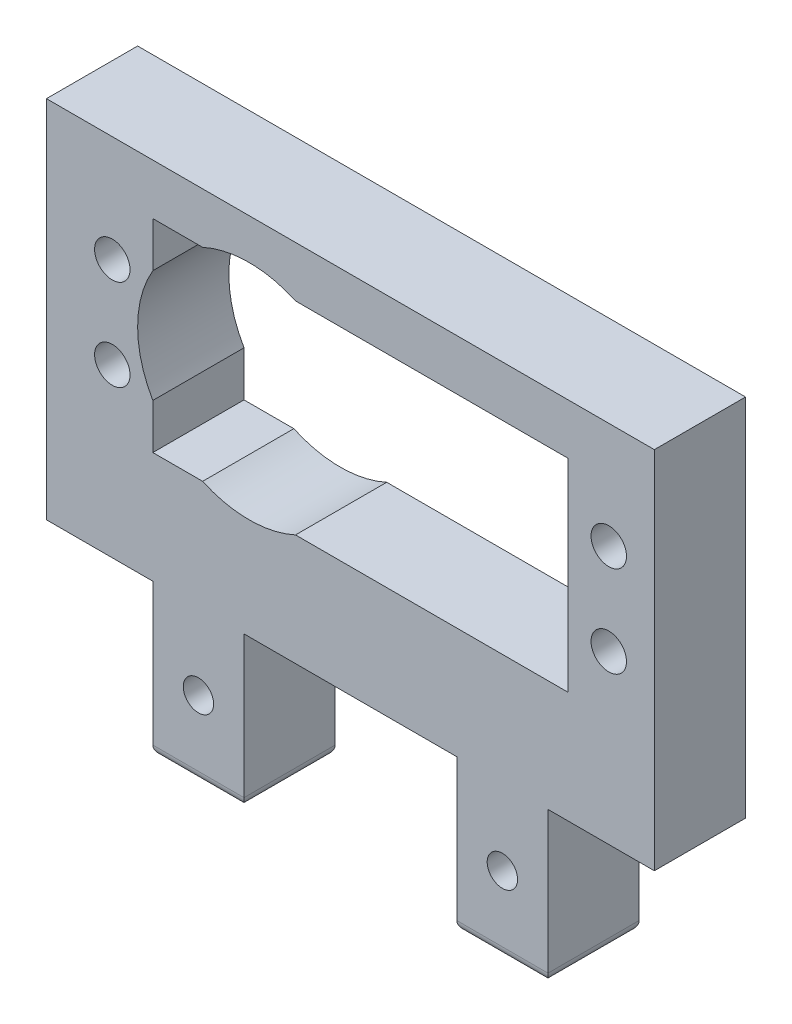
ISO-10303-21;
HEADER;
FILE_DESCRIPTION(('STEP AP214'),'2;1');
FILE_NAME('part.step','',(''),(''),'','','');
FILE_SCHEMA(('AUTOMOTIVE_DESIGN { 1 0 10303 214 1 1 1 1 }'));
ENDSEC;
DATA;
#1=APPLICATION_CONTEXT('core data for automotive mechanical design processes');
#2=APPLICATION_PROTOCOL_DEFINITION('international standard','automotive_design',2000,#1);
#3=PRODUCT_CONTEXT('',#1,'mechanical');
#4=PRODUCT('Part','Part','',(#3));
#5=PRODUCT_RELATED_PRODUCT_CATEGORY('part','',(#4));
#6=PRODUCT_DEFINITION_FORMATION('','',#4);
#7=PRODUCT_DEFINITION_CONTEXT('part definition',#1,'design');
#8=PRODUCT_DEFINITION('design','',#6,#7);
#9=PRODUCT_DEFINITION_SHAPE('','',#8);
#10=(LENGTH_UNIT() NAMED_UNIT(*) SI_UNIT(.MILLI.,.METRE.));
#11=(NAMED_UNIT(*) PLANE_ANGLE_UNIT() SI_UNIT($,.RADIAN.));
#12=(NAMED_UNIT(*) SI_UNIT($,.STERADIAN.) SOLID_ANGLE_UNIT());
#13=UNCERTAINTY_MEASURE_WITH_UNIT(LENGTH_MEASURE(1.E-05),#10,'distance_accuracy_value','');
#14=(GEOMETRIC_REPRESENTATION_CONTEXT(3) GLOBAL_UNCERTAINTY_ASSIGNED_CONTEXT((#13)) GLOBAL_UNIT_ASSIGNED_CONTEXT((#10,
#11,#12)) REPRESENTATION_CONTEXT('',''));
#15=CARTESIAN_POINT('',(0.,0.,0.));
#16=DIRECTION('',(0.,0.,1.));
#17=DIRECTION('',(1.,0.,0.));
#18=AXIS2_PLACEMENT_3D('',#15,#16,#17);
#19=CARTESIAN_POINT('',(0.,0.,9.));
#20=DIRECTION('',(0.,1.,0.));
#21=DIRECTION('',(0.,0.,1.));
#22=AXIS2_PLACEMENT_3D('',#19,#20,#21);
#23=PLANE('',#22);
#24=DIRECTION('',(1.,0.,0.));
#25=VECTOR('',#24,1.);
#26=CARTESIAN_POINT('',(0.,0.,0.));
#27=LINE('',#26,#25);
#28=CARTESIAN_POINT('',(0.,0.,0.));
#29=VERTEX_POINT('',#28);
#30=CARTESIAN_POINT('',(10.5,0.,0.));
#31=VERTEX_POINT('',#30);
#32=EDGE_CURVE('E329',#29,#31,#27,.T.);
#33=ORIENTED_EDGE('',*,*,#32,.T.);
#34=DIRECTION('',(0.,0.,-1.));
#35=VECTOR('',#34,1.);
#36=CARTESIAN_POINT('',(10.5,0.,9.));
#37=LINE('',#36,#35);
#38=CARTESIAN_POINT('',(10.5,0.,9.));
#39=VERTEX_POINT('',#38);
#40=EDGE_CURVE('E370',#39,#31,#37,.T.);
#41=ORIENTED_EDGE('',*,*,#40,.F.);
#42=DIRECTION('',(1.,0.,0.));
#43=VECTOR('',#42,1.);
#44=CARTESIAN_POINT('',(0.,0.,9.));
#45=LINE('',#44,#43);
#46=CARTESIAN_POINT('',(0.,0.,9.));
#47=VERTEX_POINT('',#46);
#48=EDGE_CURVE('E271',#47,#39,#45,.T.);
#49=ORIENTED_EDGE('',*,*,#48,.F.);
#50=DIRECTION('',(0.,0.,-1.));
#51=VECTOR('',#50,1.);
#52=CARTESIAN_POINT('',(0.,0.,9.));
#53=LINE('',#52,#51);
#54=EDGE_CURVE('E218',#47,#29,#53,.T.);
#55=ORIENTED_EDGE('',*,*,#54,.T.);
#56=EDGE_LOOP('',(#33,#41,#49,#55));
#57=FACE_BOUND('',#56,.T.);
#58=ADVANCED_FACE('F35',(#57),#23,.F.);
#59=CARTESIAN_POINT('',(10.5,0.,9.));
#60=DIRECTION('',(-1.,0.,0.));
#61=DIRECTION('',(0.,0.,1.));
#62=AXIS2_PLACEMENT_3D('',#59,#60,#61);
#63=PLANE('',#62);
#64=DIRECTION('',(0.,1.,0.));
#65=VECTOR('',#64,1.);
#66=CARTESIAN_POINT('',(10.5,0.,0.));
#67=LINE('',#66,#65);
#68=CARTESIAN_POINT('',(10.5,-14.,0.));
#69=VERTEX_POINT('',#68);
#70=EDGE_CURVE('E332',#69,#31,#67,.T.);
#71=ORIENTED_EDGE('',*,*,#70,.F.);
#72=DIRECTION('',(0.,0.,-1.));
#73=VECTOR('',#72,1.);
#74=CARTESIAN_POINT('',(10.5,-14.,9.));
#75=LINE('',#74,#73);
#76=CARTESIAN_POINT('',(10.5,-14.,9.));
#77=VERTEX_POINT('',#76);
#78=EDGE_CURVE('E44',#69,#77,#75,.F.);
#79=ORIENTED_EDGE('',*,*,#78,.T.);
#80=DIRECTION('',(0.,1.,0.));
#81=VECTOR('',#80,1.);
#82=CARTESIAN_POINT('',(10.5,0.,9.));
#83=LINE('',#82,#81);
#84=EDGE_CURVE('E274',#77,#39,#83,.T.);
#85=ORIENTED_EDGE('',*,*,#84,.T.);
#86=ORIENTED_EDGE('',*,*,#40,.T.);
#87=EDGE_LOOP('',(#71,#79,#85,#86));
#88=FACE_BOUND('',#87,.T.);
#89=ADVANCED_FACE('F486',(#88),#63,.T.);
#90=CARTESIAN_POINT('',(0.,-15.,9.));
#91=DIRECTION('',(0.,1.,0.));
#92=DIRECTION('',(0.,0.,1.));
#93=AXIS2_PLACEMENT_3D('',#90,#91,#92);
#94=PLANE('',#93);
#95=DIRECTION('',(1.,0.,0.));
#96=VECTOR('',#95,1.);
#97=CARTESIAN_POINT('',(10.5,-15.,8.));
#98=LINE('',#97,#96);
#99=CARTESIAN_POINT('',(18.5,-15.,8.));
#100=VERTEX_POINT('',#99);
#101=CARTESIAN_POINT('',(11.5,-15.,8.));
#102=VERTEX_POINT('',#101);
#103=EDGE_CURVE('E52',#100,#102,#98,.F.);
#104=ORIENTED_EDGE('',*,*,#103,.T.);
#105=DIRECTION('',(0.,0.,-1.));
#106=VECTOR('',#105,1.);
#107=CARTESIAN_POINT('',(11.5,-15.,0.));
#108=LINE('',#107,#106);
#109=CARTESIAN_POINT('',(11.5,-15.,0.999999999999999));
#110=VERTEX_POINT('',#109);
#111=EDGE_CURVE('E415',#102,#110,#108,.T.);
#112=ORIENTED_EDGE('',*,*,#111,.T.);
#113=DIRECTION('',(1.,0.,0.));
#114=VECTOR('',#113,1.);
#115=CARTESIAN_POINT('',(0.,-15.,0.999999999999999));
#116=LINE('',#115,#114);
#117=CARTESIAN_POINT('',(18.5,-15.,0.999999999999999));
#118=VERTEX_POINT('',#117);
#119=EDGE_CURVE('E411',#110,#118,#116,.T.);
#120=ORIENTED_EDGE('',*,*,#119,.T.);
#121=DIRECTION('',(0.,0.,-1.));
#122=VECTOR('',#121,1.);
#123=CARTESIAN_POINT('',(18.5,-15.,9.));
#124=LINE('',#123,#122);
#125=EDGE_CURVE('E57',#118,#100,#124,.F.);
#126=ORIENTED_EDGE('',*,*,#125,.T.);
#127=EDGE_LOOP('',(#104,#112,#120,#126));
#128=FACE_BOUND('',#127,.T.);
#129=ADVANCED_FACE('F493',(#128),#94,.F.);
#130=CARTESIAN_POINT('',(19.5,0.,9.));
#131=DIRECTION('',(-1.,0.,0.));
#132=DIRECTION('',(0.,-1.,0.));
#133=AXIS2_PLACEMENT_3D('',#130,#131,#132);
#134=PLANE('',#133);
#135=DIRECTION('',(0.,1.,0.));
#136=VECTOR('',#135,1.);
#137=CARTESIAN_POINT('',(19.5,0.,9.));
#138=LINE('',#137,#136);
#139=CARTESIAN_POINT('',(19.5,-14.,9.));
#140=VERTEX_POINT('',#139);
#141=CARTESIAN_POINT('',(19.5,0.,9.));
#142=VERTEX_POINT('',#141);
#143=EDGE_CURVE('E278',#140,#142,#138,.T.);
#144=ORIENTED_EDGE('',*,*,#143,.F.);
#145=DIRECTION('',(0.,0.,-1.));
#146=VECTOR('',#145,1.);
#147=CARTESIAN_POINT('',(19.5,-14.,9.));
#148=LINE('',#147,#146);
#149=CARTESIAN_POINT('',(19.5,-14.,0.));
#150=VERTEX_POINT('',#149);
#151=EDGE_CURVE('E11',#140,#150,#148,.T.);
#152=ORIENTED_EDGE('',*,*,#151,.T.);
#153=DIRECTION('',(0.,1.,0.));
#154=VECTOR('',#153,1.);
#155=CARTESIAN_POINT('',(19.5,0.,0.));
#156=LINE('',#155,#154);
#157=CARTESIAN_POINT('',(19.5,0.,0.));
#158=VERTEX_POINT('',#157);
#159=EDGE_CURVE('E336',#150,#158,#156,.T.);
#160=ORIENTED_EDGE('',*,*,#159,.T.);
#161=DIRECTION('',(0.,0.,-1.));
#162=VECTOR('',#161,1.);
#163=CARTESIAN_POINT('',(19.5,0.,9.));
#164=LINE('',#163,#162);
#165=EDGE_CURVE('E367',#142,#158,#164,.T.);
#166=ORIENTED_EDGE('',*,*,#165,.F.);
#167=EDGE_LOOP('',(#144,#152,#160,#166));
#168=FACE_BOUND('',#167,.T.);
#169=ADVANCED_FACE('F446',(#168),#134,.F.);
#170=CARTESIAN_POINT('',(40.5,0.,0.));
#171=VERTEX_POINT('',#170);
#172=EDGE_CURVE('E334',#158,#171,#27,.T.);
#173=ORIENTED_EDGE('',*,*,#172,.T.);
#174=DIRECTION('',(0.,0.,-1.));
#175=VECTOR('',#174,1.);
#176=CARTESIAN_POINT('',(40.5,0.,9.));
#177=LINE('',#176,#175);
#178=CARTESIAN_POINT('',(40.5,0.,9.));
#179=VERTEX_POINT('',#178);
#180=EDGE_CURVE('E364',#179,#171,#177,.T.);
#181=ORIENTED_EDGE('',*,*,#180,.F.);
#182=EDGE_CURVE('E276',#142,#179,#45,.T.);
#183=ORIENTED_EDGE('',*,*,#182,.F.);
#184=ORIENTED_EDGE('',*,*,#165,.T.);
#185=EDGE_LOOP('',(#173,#181,#183,#184));
#186=FACE_BOUND('',#185,.T.);
#187=ADVANCED_FACE('F500',(#186),#23,.F.);
#188=CARTESIAN_POINT('',(40.5,0.,9.));
#189=DIRECTION('',(-1.,0.,0.));
#190=DIRECTION('',(0.,-1.,0.));
#191=AXIS2_PLACEMENT_3D('',#188,#189,#190);
#192=PLANE('',#191);
#193=DIRECTION('',(0.,1.,0.));
#194=VECTOR('',#193,1.);
#195=CARTESIAN_POINT('',(40.5,0.,0.));
#196=LINE('',#195,#194);
#197=CARTESIAN_POINT('',(40.5,-14.,0.));
#198=VERTEX_POINT('',#197);
#199=EDGE_CURVE('E338',#198,#171,#196,.T.);
#200=ORIENTED_EDGE('',*,*,#199,.F.);
#201=DIRECTION('',(0.,0.,-1.));
#202=VECTOR('',#201,1.);
#203=CARTESIAN_POINT('',(40.5,-14.,9.));
#204=LINE('',#203,#202);
#205=CARTESIAN_POINT('',(40.5,-14.,9.));
#206=VERTEX_POINT('',#205);
#207=EDGE_CURVE('E398',#198,#206,#204,.F.);
#208=ORIENTED_EDGE('',*,*,#207,.T.);
#209=DIRECTION('',(0.,1.,0.));
#210=VECTOR('',#209,1.);
#211=CARTESIAN_POINT('',(40.5,0.,9.));
#212=LINE('',#211,#210);
#213=EDGE_CURVE('E280',#206,#179,#212,.T.);
#214=ORIENTED_EDGE('',*,*,#213,.T.);
#215=ORIENTED_EDGE('',*,*,#180,.T.);
#216=EDGE_LOOP('',(#200,#208,#214,#215));
#217=FACE_BOUND('',#216,.T.);
#218=ADVANCED_FACE('F510',(#217),#192,.T.);
#219=CARTESIAN_POINT('',(0.,-15.,9.));
#220=DIRECTION('',(0.,-1.,0.));
#221=DIRECTION('',(1.,0.,0.));
#222=AXIS2_PLACEMENT_3D('',#219,#220,#221);
#223=PLANE('',#222);
#224=DIRECTION('',(-1.,0.,0.));
#225=VECTOR('',#224,1.);
#226=CARTESIAN_POINT('',(0.,-15.,8.));
#227=LINE('',#226,#225);
#228=CARTESIAN_POINT('',(48.5,-15.,8.));
#229=VERTEX_POINT('',#228);
#230=CARTESIAN_POINT('',(41.5,-15.,8.));
#231=VERTEX_POINT('',#230);
#232=EDGE_CURVE('E393',#229,#231,#227,.T.);
#233=ORIENTED_EDGE('',*,*,#232,.T.);
#234=DIRECTION('',(0.,0.,-1.));
#235=VECTOR('',#234,1.);
#236=CARTESIAN_POINT('',(41.5,-15.,9.));
#237=LINE('',#236,#235);
#238=CARTESIAN_POINT('',(41.5,-15.,1.));
#239=VERTEX_POINT('',#238);
#240=EDGE_CURVE('E395',#231,#239,#237,.T.);
#241=ORIENTED_EDGE('',*,*,#240,.T.);
#242=DIRECTION('',(-1.,0.,0.));
#243=VECTOR('',#242,1.);
#244=CARTESIAN_POINT('',(49.5,-15.,1.));
#245=LINE('',#244,#243);
#246=CARTESIAN_POINT('',(48.5,-15.,1.));
#247=VERTEX_POINT('',#246);
#248=EDGE_CURVE('E373',#239,#247,#245,.F.);
#249=ORIENTED_EDGE('',*,*,#248,.T.);
#250=DIRECTION('',(0.,0.,-1.));
#251=VECTOR('',#250,1.);
#252=CARTESIAN_POINT('',(48.5,-15.,9.));
#253=LINE('',#252,#251);
#254=EDGE_CURVE('E391',#247,#229,#253,.F.);
#255=ORIENTED_EDGE('',*,*,#254,.T.);
#256=EDGE_LOOP('',(#233,#241,#249,#255));
#257=FACE_BOUND('',#256,.T.);
#258=ADVANCED_FACE('F517',(#257),#223,.T.);
#259=CARTESIAN_POINT('',(49.5,0.,9.));
#260=DIRECTION('',(-1.,0.,0.));
#261=DIRECTION('',(0.,0.,1.));
#262=AXIS2_PLACEMENT_3D('',#259,#260,#261);
#263=PLANE('',#262);
#264=DIRECTION('',(0.,1.,0.));
#265=VECTOR('',#264,1.);
#266=CARTESIAN_POINT('',(49.5,0.,9.));
#267=LINE('',#266,#265);
#268=CARTESIAN_POINT('',(49.5,-14.,9.));
#269=VERTEX_POINT('',#268);
#270=CARTESIAN_POINT('',(49.5,0.,9.));
#271=VERTEX_POINT('',#270);
#272=EDGE_CURVE('E282',#269,#271,#267,.T.);
#273=ORIENTED_EDGE('',*,*,#272,.F.);
#274=DIRECTION('',(0.,0.,-1.));
#275=VECTOR('',#274,1.);
#276=CARTESIAN_POINT('',(49.5,-14.,0.));
#277=LINE('',#276,#275);
#278=CARTESIAN_POINT('',(49.5,-14.,0.));
#279=VERTEX_POINT('',#278);
#280=EDGE_CURVE('E405',#269,#279,#277,.T.);
#281=ORIENTED_EDGE('',*,*,#280,.T.);
#282=DIRECTION('',(0.,1.,0.));
#283=VECTOR('',#282,1.);
#284=CARTESIAN_POINT('',(49.5,0.,0.));
#285=LINE('',#284,#283);
#286=CARTESIAN_POINT('',(49.5,0.,0.));
#287=VERTEX_POINT('',#286);
#288=EDGE_CURVE('E340',#279,#287,#285,.T.);
#289=ORIENTED_EDGE('',*,*,#288,.T.);
#290=DIRECTION('',(0.,0.,-1.));
#291=VECTOR('',#290,1.);
#292=CARTESIAN_POINT('',(49.5,0.,9.));
#293=LINE('',#292,#291);
#294=EDGE_CURVE('E361',#271,#287,#293,.T.);
#295=ORIENTED_EDGE('',*,*,#294,.F.);
#296=EDGE_LOOP('',(#273,#281,#289,#295));
#297=FACE_BOUND('',#296,.T.);
#298=ADVANCED_FACE('F512',(#297),#263,.F.);
#299=CARTESIAN_POINT('',(60.,0.,0.));
#300=VERTEX_POINT('',#299);
#301=EDGE_CURVE('E333',#287,#300,#27,.T.);
#302=ORIENTED_EDGE('',*,*,#301,.T.);
#303=DIRECTION('',(0.,0.,-1.));
#304=VECTOR('',#303,1.);
#305=CARTESIAN_POINT('',(60.,0.,9.));
#306=LINE('',#305,#304);
#307=CARTESIAN_POINT('',(60.,0.,9.));
#308=VERTEX_POINT('',#307);
#309=EDGE_CURVE('E358',#308,#300,#306,.T.);
#310=ORIENTED_EDGE('',*,*,#309,.F.);
#311=EDGE_CURVE('E275',#271,#308,#45,.T.);
#312=ORIENTED_EDGE('',*,*,#311,.F.);
#313=ORIENTED_EDGE('',*,*,#294,.T.);
#314=EDGE_LOOP('',(#302,#310,#312,#313));
#315=FACE_BOUND('',#314,.T.);
#316=ADVANCED_FACE('F461',(#315),#23,.F.);
#317=CARTESIAN_POINT('',(60.,0.,9.));
#318=DIRECTION('',(-1.,0.,0.));
#319=DIRECTION('',(0.,-1.,0.));
#320=AXIS2_PLACEMENT_3D('',#317,#318,#319);
#321=PLANE('',#320);
#322=DIRECTION('',(0.,1.,0.));
#323=VECTOR('',#322,1.);
#324=CARTESIAN_POINT('',(60.,0.,0.));
#325=LINE('',#324,#323);
#326=CARTESIAN_POINT('',(60.,36.,0.));
#327=VERTEX_POINT('',#326);
#328=EDGE_CURVE('E342',#300,#327,#325,.T.);
#329=ORIENTED_EDGE('',*,*,#328,.T.);
#330=DIRECTION('',(0.,0.,-1.));
#331=VECTOR('',#330,1.);
#332=CARTESIAN_POINT('',(60.,36.,9.));
#333=LINE('',#332,#331);
#334=CARTESIAN_POINT('',(60.,36.,9.));
#335=VERTEX_POINT('',#334);
#336=EDGE_CURVE('E356',#335,#327,#333,.T.);
#337=ORIENTED_EDGE('',*,*,#336,.F.);
#338=DIRECTION('',(0.,1.,0.));
#339=VECTOR('',#338,1.);
#340=CARTESIAN_POINT('',(60.,0.,9.));
#341=LINE('',#340,#339);
#342=EDGE_CURVE('E284',#308,#335,#341,.T.);
#343=ORIENTED_EDGE('',*,*,#342,.F.);
#344=ORIENTED_EDGE('',*,*,#309,.T.);
#345=EDGE_LOOP('',(#329,#337,#343,#344));
#346=FACE_BOUND('',#345,.T.);
#347=ADVANCED_FACE('F467',(#346),#321,.F.);
#348=CARTESIAN_POINT('',(0.,36.,9.));
#349=DIRECTION('',(0.,1.,0.));
#350=DIRECTION('',(0.,0.,1.));
#351=AXIS2_PLACEMENT_3D('',#348,#349,#350);
#352=PLANE('',#351);
#353=DIRECTION('',(1.,0.,0.));
#354=VECTOR('',#353,1.);
#355=CARTESIAN_POINT('',(0.,36.,0.));
#356=LINE('',#355,#354);
#357=CARTESIAN_POINT('',(0.,36.,0.));
#358=VERTEX_POINT('',#357);
#359=EDGE_CURVE('E345',#358,#327,#356,.T.);
#360=ORIENTED_EDGE('',*,*,#359,.F.);
#361=DIRECTION('',(0.,0.,-1.));
#362=VECTOR('',#361,1.);
#363=CARTESIAN_POINT('',(0.,36.,9.));
#364=LINE('',#363,#362);
#365=CARTESIAN_POINT('',(0.,36.,9.));
#366=VERTEX_POINT('',#365);
#367=EDGE_CURVE('E354',#366,#358,#364,.T.);
#368=ORIENTED_EDGE('',*,*,#367,.F.);
#369=DIRECTION('',(1.,0.,0.));
#370=VECTOR('',#369,1.);
#371=CARTESIAN_POINT('',(0.,36.,9.));
#372=LINE('',#371,#370);
#373=EDGE_CURVE('E286',#366,#335,#372,.T.);
#374=ORIENTED_EDGE('',*,*,#373,.T.);
#375=ORIENTED_EDGE('',*,*,#336,.T.);
#376=EDGE_LOOP('',(#360,#368,#374,#375));
#377=FACE_BOUND('',#376,.T.);
#378=ADVANCED_FACE('F473',(#377),#352,.T.);
#379=CARTESIAN_POINT('',(20.,21.,9.));
#380=DIRECTION('',(0.,0.,-1.));
#381=DIRECTION('',(-1.,0.,0.));
#382=AXIS2_PLACEMENT_3D('',#379,#380,#381);
#383=CYLINDRICAL_SURFACE('',#382,11.);
#384=CARTESIAN_POINT('',(20.,21.,0.));
#385=DIRECTION('',(0.,0.,1.));
#386=DIRECTION('',(1.,0.,0.));
#387=AXIS2_PLACEMENT_3D('',#384,#385,#386);
#388=CIRCLE('',#387,11.);
#389=CARTESIAN_POINT('',(24.5825756949558,31.,0.));
#390=VERTEX_POINT('',#389);
#391=CARTESIAN_POINT('',(15.4174243050442,31.,0.));
#392=VERTEX_POINT('',#391);
#393=EDGE_CURVE('E215',#390,#392,#388,.T.);
#394=ORIENTED_EDGE('',*,*,#393,.F.);
#395=DIRECTION('',(0.,0.,-1.));
#396=VECTOR('',#395,1.);
#397=CARTESIAN_POINT('',(24.5825756949558,31.,9.));
#398=LINE('',#397,#396);
#399=CARTESIAN_POINT('',(24.5825756949558,31.,9.));
#400=VERTEX_POINT('',#399);
#401=EDGE_CURVE('E209',#400,#390,#398,.T.);
#402=ORIENTED_EDGE('',*,*,#401,.F.);
#403=CARTESIAN_POINT('',(20.,21.,9.));
#404=DIRECTION('',(0.,0.,1.));
#405=DIRECTION('',(1.,0.,0.));
#406=AXIS2_PLACEMENT_3D('',#403,#404,#405);
#407=CIRCLE('',#406,11.);
#408=CARTESIAN_POINT('',(15.4174243050442,31.,9.));
#409=VERTEX_POINT('',#408);
#410=EDGE_CURVE('E213',#400,#409,#407,.T.);
#411=ORIENTED_EDGE('',*,*,#410,.T.);
#412=DIRECTION('',(0.,0.,-1.));
#413=VECTOR('',#412,1.);
#414=CARTESIAN_POINT('',(15.4174243050442,31.,9.));
#415=LINE('',#414,#413);
#416=EDGE_CURVE('E298',#409,#392,#415,.T.);
#417=ORIENTED_EDGE('',*,*,#416,.T.);
#418=EDGE_LOOP('',(#394,#402,#411,#417));
#419=FACE_BOUND('',#418,.T.);
#420=ADVANCED_FACE('F211',(#419),#383,.F.);
#421=CARTESIAN_POINT('',(0.,31.,9.));
#422=DIRECTION('',(0.,1.,0.));
#423=DIRECTION('',(0.,0.,1.));
#424=AXIS2_PLACEMENT_3D('',#421,#422,#423);
#425=PLANE('',#424);
#426=DIRECTION('',(1.,0.,0.));
#427=VECTOR('',#426,1.);
#428=CARTESIAN_POINT('',(0.,31.,0.));
#429=LINE('',#428,#427);
#430=CARTESIAN_POINT('',(51.5,31.,0.));
#431=VERTEX_POINT('',#430);
#432=EDGE_CURVE('E300',#390,#431,#429,.T.);
#433=ORIENTED_EDGE('',*,*,#432,.T.);
#434=DIRECTION('',(0.,0.,-1.));
#435=VECTOR('',#434,1.);
#436=CARTESIAN_POINT('',(51.5,31.,9.));
#437=LINE('',#436,#435);
#438=CARTESIAN_POINT('',(51.5,31.,9.));
#439=VERTEX_POINT('',#438);
#440=EDGE_CURVE('E219',#439,#431,#437,.T.);
#441=ORIENTED_EDGE('',*,*,#440,.F.);
#442=DIRECTION('',(1.,0.,0.));
#443=VECTOR('',#442,1.);
#444=CARTESIAN_POINT('',(0.,31.,9.));
#445=LINE('',#444,#443);
#446=EDGE_CURVE('E222',#400,#439,#445,.T.);
#447=ORIENTED_EDGE('',*,*,#446,.F.);
#448=ORIENTED_EDGE('',*,*,#401,.T.);
#449=EDGE_LOOP('',(#433,#441,#447,#448));
#450=FACE_BOUND('',#449,.T.);
#451=ADVANCED_FACE('F223',(#450),#425,.F.);
#452=CARTESIAN_POINT('',(51.5,0.,9.));
#453=DIRECTION('',(1.,0.,0.));
#454=DIRECTION('',(0.,1.,0.));
#455=AXIS2_PLACEMENT_3D('',#452,#453,#454);
#456=PLANE('',#455);
#457=DIRECTION('',(0.,-1.,0.));
#458=VECTOR('',#457,1.);
#459=CARTESIAN_POINT('',(51.5,0.,0.));
#460=LINE('',#459,#458);
#461=CARTESIAN_POINT('',(51.5,11.,0.));
#462=VERTEX_POINT('',#461);
#463=EDGE_CURVE('E305',#431,#462,#460,.T.);
#464=ORIENTED_EDGE('',*,*,#463,.T.);
#465=DIRECTION('',(0.,0.,-1.));
#466=VECTOR('',#465,1.);
#467=CARTESIAN_POINT('',(51.5,11.,9.));
#468=LINE('',#467,#466);
#469=CARTESIAN_POINT('',(51.5,11.,9.));
#470=VERTEX_POINT('',#469);
#471=EDGE_CURVE('E387',#470,#462,#468,.T.);
#472=ORIENTED_EDGE('',*,*,#471,.F.);
#473=DIRECTION('',(0.,-1.,0.));
#474=VECTOR('',#473,1.);
#475=CARTESIAN_POINT('',(51.5,0.,9.));
#476=LINE('',#475,#474);
#477=EDGE_CURVE('E227',#439,#470,#476,.T.);
#478=ORIENTED_EDGE('',*,*,#477,.F.);
#479=ORIENTED_EDGE('',*,*,#440,.T.);
#480=EDGE_LOOP('',(#464,#472,#478,#479));
#481=FACE_BOUND('',#480,.T.);
#482=ADVANCED_FACE('F577',(#481),#456,.F.);
#483=CARTESIAN_POINT('',(0.,11.,9.));
#484=DIRECTION('',(0.,1.,0.));
#485=DIRECTION('',(0.,0.,1.));
#486=AXIS2_PLACEMENT_3D('',#483,#484,#485);
#487=PLANE('',#486);
#488=DIRECTION('',(1.,0.,0.));
#489=VECTOR('',#488,1.);
#490=CARTESIAN_POINT('',(0.,11.,0.));
#491=LINE('',#490,#489);
#492=CARTESIAN_POINT('',(24.5825756949558,11.,0.));
#493=VERTEX_POINT('',#492);
#494=EDGE_CURVE('E309',#493,#462,#491,.T.);
#495=ORIENTED_EDGE('',*,*,#494,.F.);
#496=DIRECTION('',(0.,0.,-1.));
#497=VECTOR('',#496,1.);
#498=CARTESIAN_POINT('',(24.5825756949558,11.,9.));
#499=LINE('',#498,#497);
#500=CARTESIAN_POINT('',(24.5825756949558,11.,9.));
#501=VERTEX_POINT('',#500);
#502=EDGE_CURVE('E385',#501,#493,#499,.T.);
#503=ORIENTED_EDGE('',*,*,#502,.F.);
#504=DIRECTION('',(1.,0.,0.));
#505=VECTOR('',#504,1.);
#506=CARTESIAN_POINT('',(0.,11.,9.));
#507=LINE('',#506,#505);
#508=EDGE_CURVE('E247',#501,#470,#507,.T.);
#509=ORIENTED_EDGE('',*,*,#508,.T.);
#510=ORIENTED_EDGE('',*,*,#471,.T.);
#511=EDGE_LOOP('',(#495,#503,#509,#510));
#512=FACE_BOUND('',#511,.T.);
#513=ADVANCED_FACE('F580',(#512),#487,.T.);
#514=CARTESIAN_POINT('',(15.4174243050442,11.,0.));
#515=VERTEX_POINT('',#514);
#516=EDGE_CURVE('E303',#515,#493,#388,.T.);
#517=ORIENTED_EDGE('',*,*,#516,.F.);
#518=DIRECTION('',(0.,0.,-1.));
#519=VECTOR('',#518,1.);
#520=CARTESIAN_POINT('',(15.4174243050442,11.,9.));
#521=LINE('',#520,#519);
#522=CARTESIAN_POINT('',(15.4174243050442,11.,9.));
#523=VERTEX_POINT('',#522);
#524=EDGE_CURVE('E383',#523,#515,#521,.T.);
#525=ORIENTED_EDGE('',*,*,#524,.F.);
#526=EDGE_CURVE('E238',#523,#501,#407,.T.);
#527=ORIENTED_EDGE('',*,*,#526,.T.);
#528=ORIENTED_EDGE('',*,*,#502,.T.);
#529=EDGE_LOOP('',(#517,#525,#527,#528));
#530=FACE_BOUND('',#529,.T.);
#531=ADVANCED_FACE('F586',(#530),#383,.F.);
#532=CARTESIAN_POINT('',(10.5,11.,0.));
#533=VERTEX_POINT('',#532);
#534=EDGE_CURVE('E312',#533,#515,#491,.T.);
#535=ORIENTED_EDGE('',*,*,#534,.F.);
#536=DIRECTION('',(0.,0.,-1.));
#537=VECTOR('',#536,1.);
#538=CARTESIAN_POINT('',(10.5,11.,9.));
#539=LINE('',#538,#537);
#540=CARTESIAN_POINT('',(10.5,11.,9.));
#541=VERTEX_POINT('',#540);
#542=EDGE_CURVE('E381',#541,#533,#539,.T.);
#543=ORIENTED_EDGE('',*,*,#542,.F.);
#544=EDGE_CURVE('E246',#541,#523,#507,.T.);
#545=ORIENTED_EDGE('',*,*,#544,.T.);
#546=ORIENTED_EDGE('',*,*,#524,.T.);
#547=EDGE_LOOP('',(#535,#543,#545,#546));
#548=FACE_BOUND('',#547,.T.);
#549=ADVANCED_FACE('F582',(#548),#487,.T.);
#550=CARTESIAN_POINT('',(10.5,0.,9.));
#551=DIRECTION('',(1.,0.,0.));
#552=DIRECTION('',(0.,1.,0.));
#553=AXIS2_PLACEMENT_3D('',#550,#551,#552);
#554=PLANE('',#553);
#555=DIRECTION('',(0.,-1.,0.));
#556=VECTOR('',#555,1.);
#557=CARTESIAN_POINT('',(10.5,0.,0.));
#558=LINE('',#557,#556);
#559=CARTESIAN_POINT('',(10.5,15.4547317467953,0.));
#560=VERTEX_POINT('',#559);
#561=EDGE_CURVE('E313',#560,#533,#558,.T.);
#562=ORIENTED_EDGE('',*,*,#561,.F.);
#563=DIRECTION('',(0.,0.,-1.));
#564=VECTOR('',#563,1.);
#565=CARTESIAN_POINT('',(10.5,15.4547317467953,9.));
#566=LINE('',#565,#564);
#567=CARTESIAN_POINT('',(10.5,15.4547317467953,9.));
#568=VERTEX_POINT('',#567);
#569=EDGE_CURVE('E379',#568,#560,#566,.T.);
#570=ORIENTED_EDGE('',*,*,#569,.F.);
#571=DIRECTION('',(0.,-1.,0.));
#572=VECTOR('',#571,1.);
#573=CARTESIAN_POINT('',(10.5,0.,9.));
#574=LINE('',#573,#572);
#575=EDGE_CURVE('E244',#568,#541,#574,.T.);
#576=ORIENTED_EDGE('',*,*,#575,.T.);
#577=ORIENTED_EDGE('',*,*,#542,.T.);
#578=EDGE_LOOP('',(#562,#570,#576,#577));
#579=FACE_BOUND('',#578,.T.);
#580=ADVANCED_FACE('F585',(#579),#554,.T.);
#581=CARTESIAN_POINT('',(10.5,26.5452682532047,0.));
#582=VERTEX_POINT('',#581);
#583=EDGE_CURVE('E302',#582,#560,#388,.T.);
#584=ORIENTED_EDGE('',*,*,#583,.F.);
#585=DIRECTION('',(0.,0.,-1.));
#586=VECTOR('',#585,1.);
#587=CARTESIAN_POINT('',(10.5,26.5452682532047,9.));
#588=LINE('',#587,#586);
#589=CARTESIAN_POINT('',(10.5,26.5452682532047,9.));
#590=VERTEX_POINT('',#589);
#591=EDGE_CURVE('E377',#590,#582,#588,.T.);
#592=ORIENTED_EDGE('',*,*,#591,.F.);
#593=EDGE_CURVE('E237',#590,#568,#407,.T.);
#594=ORIENTED_EDGE('',*,*,#593,.T.);
#595=ORIENTED_EDGE('',*,*,#569,.T.);
#596=EDGE_LOOP('',(#584,#592,#594,#595));
#597=FACE_BOUND('',#596,.T.);
#598=ADVANCED_FACE('F588',(#597),#383,.F.);
#599=CARTESIAN_POINT('',(10.5,31.,0.));
#600=VERTEX_POINT('',#599);
#601=EDGE_CURVE('E316',#600,#582,#558,.T.);
#602=ORIENTED_EDGE('',*,*,#601,.F.);
#603=DIRECTION('',(0.,0.,-1.));
#604=VECTOR('',#603,1.);
#605=CARTESIAN_POINT('',(10.5,31.,9.));
#606=LINE('',#605,#604);
#607=CARTESIAN_POINT('',(10.5,31.,9.));
#608=VERTEX_POINT('',#607);
#609=EDGE_CURVE('E375',#608,#600,#606,.T.);
#610=ORIENTED_EDGE('',*,*,#609,.F.);
#611=EDGE_CURVE('E243',#608,#590,#574,.T.);
#612=ORIENTED_EDGE('',*,*,#611,.T.);
#613=ORIENTED_EDGE('',*,*,#591,.T.);
#614=EDGE_LOOP('',(#602,#610,#612,#613));
#615=FACE_BOUND('',#614,.T.);
#616=ADVANCED_FACE('F591',(#615),#554,.T.);
#617=CARTESIAN_POINT('',(45.,-7.5,9.));
#618=DIRECTION('',(0.,0.,-1.));
#619=DIRECTION('',(-1.,0.,0.));
#620=AXIS2_PLACEMENT_3D('',#617,#618,#619);
#621=CYLINDRICAL_SURFACE('',#620,1.5);
#622=CARTESIAN_POINT('',(45.,-7.5,9.));
#623=DIRECTION('',(0.,0.,1.));
#624=DIRECTION('',(1.,0.,0.));
#625=AXIS2_PLACEMENT_3D('',#622,#623,#624);
#626=CIRCLE('',#625,1.5);
#627=CARTESIAN_POINT('',(46.5,-7.5,9.));
#628=VERTEX_POINT('',#627);
#629=EDGE_CURVE('E292',#628,#628,#626,.T.);
#630=ORIENTED_EDGE('',*,*,#629,.T.);
#631=EDGE_LOOP('',(#630));
#632=FACE_BOUND('',#631,.T.);
#633=CARTESIAN_POINT('',(45.,-7.5,0.));
#634=DIRECTION('',(0.,0.,1.));
#635=DIRECTION('',(1.,0.,0.));
#636=AXIS2_PLACEMENT_3D('',#633,#634,#635);
#637=CIRCLE('',#636,1.5);
#638=CARTESIAN_POINT('',(46.5,-7.5,0.));
#639=VERTEX_POINT('',#638);
#640=EDGE_CURVE('E240',#639,#639,#637,.T.);
#641=ORIENTED_EDGE('',*,*,#640,.F.);
#642=EDGE_LOOP('',(#641));
#643=FACE_BOUND('',#642,.T.);
#644=ADVANCED_FACE('F595',(#632,#643),#621,.F.);
#645=CARTESIAN_POINT('',(0.,0.,9.));
#646=DIRECTION('',(-1.,0.,0.));
#647=DIRECTION('',(0.,0.,1.));
#648=AXIS2_PLACEMENT_3D('',#645,#646,#647);
#649=PLANE('',#648);
#650=DIRECTION('',(0.,1.,0.));
#651=VECTOR('',#650,1.);
#652=CARTESIAN_POINT('',(0.,0.,0.));
#653=LINE('',#652,#651);
#654=EDGE_CURVE('E348',#29,#358,#653,.T.);
#655=ORIENTED_EDGE('',*,*,#654,.F.);
#656=ORIENTED_EDGE('',*,*,#54,.F.);
#657=DIRECTION('',(0.,1.,0.));
#658=VECTOR('',#657,1.);
#659=CARTESIAN_POINT('',(0.,0.,9.));
#660=LINE('',#659,#658);
#661=EDGE_CURVE('E289',#47,#366,#660,.T.);
#662=ORIENTED_EDGE('',*,*,#661,.T.);
#663=ORIENTED_EDGE('',*,*,#367,.T.);
#664=EDGE_LOOP('',(#655,#656,#662,#663));
#665=FACE_BOUND('',#664,.T.);
#666=ADVANCED_FACE('F480',(#665),#649,.T.);
#667=CARTESIAN_POINT('',(6.5,25.5,9.));
#668=DIRECTION('',(0.,0.,-1.));
#669=DIRECTION('',(-1.,0.,0.));
#670=AXIS2_PLACEMENT_3D('',#667,#668,#669);
#671=CYLINDRICAL_SURFACE('',#670,1.75000000000001);
#672=CARTESIAN_POINT('',(6.5,25.5,9.));
#673=DIRECTION('',(0.,0.,1.));
#674=DIRECTION('',(1.,0.,0.));
#675=AXIS2_PLACEMENT_3D('',#672,#673,#674);
#676=CIRCLE('',#675,1.75000000000001);
#677=CARTESIAN_POINT('',(8.25,25.5,9.));
#678=VERTEX_POINT('',#677);
#679=EDGE_CURVE('E268',#678,#678,#676,.T.);
#680=ORIENTED_EDGE('',*,*,#679,.T.);
#681=EDGE_LOOP('',(#680));
#682=FACE_BOUND('',#681,.T.);
#683=CARTESIAN_POINT('',(6.5,25.5,0.));
#684=DIRECTION('',(0.,0.,1.));
#685=DIRECTION('',(1.,0.,0.));
#686=AXIS2_PLACEMENT_3D('',#683,#684,#685);
#687=CIRCLE('',#686,1.75000000000001);
#688=CARTESIAN_POINT('',(8.25,25.5,0.));
#689=VERTEX_POINT('',#688);
#690=EDGE_CURVE('E326',#689,#689,#687,.T.);
#691=ORIENTED_EDGE('',*,*,#690,.F.);
#692=EDGE_LOOP('',(#691));
#693=FACE_BOUND('',#692,.T.);
#694=ADVANCED_FACE('F613',(#682,#693),#671,.F.);
#695=CARTESIAN_POINT('',(6.5,16.5,9.));
#696=DIRECTION('',(0.,0.,-1.));
#697=DIRECTION('',(-1.,0.,0.));
#698=AXIS2_PLACEMENT_3D('',#695,#696,#697);
#699=CYLINDRICAL_SURFACE('',#698,1.75);
#700=CARTESIAN_POINT('',(6.5,16.5,9.));
#701=DIRECTION('',(0.,0.,1.));
#702=DIRECTION('',(1.,0.,0.));
#703=AXIS2_PLACEMENT_3D('',#700,#701,#702);
#704=CIRCLE('',#703,1.75);
#705=CARTESIAN_POINT('',(8.25,16.5,9.));
#706=VERTEX_POINT('',#705);
#707=EDGE_CURVE('E265',#706,#706,#704,.T.);
#708=ORIENTED_EDGE('',*,*,#707,.T.);
#709=EDGE_LOOP('',(#708));
#710=FACE_BOUND('',#709,.T.);
#711=CARTESIAN_POINT('',(6.5,16.5,0.));
#712=DIRECTION('',(0.,0.,1.));
#713=DIRECTION('',(1.,0.,0.));
#714=AXIS2_PLACEMENT_3D('',#711,#712,#713);
#715=CIRCLE('',#714,1.75);
#716=CARTESIAN_POINT('',(8.25,16.5,0.));
#717=VERTEX_POINT('',#716);
#718=EDGE_CURVE('E323',#717,#717,#715,.T.);
#719=ORIENTED_EDGE('',*,*,#718,.F.);
#720=EDGE_LOOP('',(#719));
#721=FACE_BOUND('',#720,.T.);
#722=ADVANCED_FACE('F609',(#710,#721),#699,.F.);
#723=CARTESIAN_POINT('',(55.5,25.5,9.));
#724=DIRECTION('',(0.,0.,-1.));
#725=DIRECTION('',(-1.,0.,0.));
#726=AXIS2_PLACEMENT_3D('',#723,#724,#725);
#727=CYLINDRICAL_SURFACE('',#726,1.75);
#728=CARTESIAN_POINT('',(55.5,25.5,9.));
#729=DIRECTION('',(0.,0.,1.));
#730=DIRECTION('',(1.,0.,0.));
#731=AXIS2_PLACEMENT_3D('',#728,#729,#730);
#732=CIRCLE('',#731,1.75);
#733=CARTESIAN_POINT('',(57.25,25.5,9.));
#734=VERTEX_POINT('',#733);
#735=EDGE_CURVE('E262',#734,#734,#732,.T.);
#736=ORIENTED_EDGE('',*,*,#735,.T.);
#737=EDGE_LOOP('',(#736));
#738=FACE_BOUND('',#737,.T.);
#739=CARTESIAN_POINT('',(55.5,25.5,0.));
#740=DIRECTION('',(0.,0.,1.));
#741=DIRECTION('',(1.,0.,0.));
#742=AXIS2_PLACEMENT_3D('',#739,#740,#741);
#743=CIRCLE('',#742,1.75);
#744=CARTESIAN_POINT('',(57.25,25.5,0.));
#745=VERTEX_POINT('',#744);
#746=EDGE_CURVE('E320',#745,#745,#743,.T.);
#747=ORIENTED_EDGE('',*,*,#746,.F.);
#748=EDGE_LOOP('',(#747));
#749=FACE_BOUND('',#748,.T.);
#750=ADVANCED_FACE('F605',(#738,#749),#727,.F.);
#751=CARTESIAN_POINT('',(55.5,16.5,9.));
#752=DIRECTION('',(0.,0.,-1.));
#753=DIRECTION('',(-1.,0.,0.));
#754=AXIS2_PLACEMENT_3D('',#751,#752,#753);
#755=CYLINDRICAL_SURFACE('',#754,1.75);
#756=CARTESIAN_POINT('',(55.5,16.5,9.));
#757=DIRECTION('',(0.,0.,1.));
#758=DIRECTION('',(1.,0.,0.));
#759=AXIS2_PLACEMENT_3D('',#756,#757,#758);
#760=CIRCLE('',#759,1.75);
#761=CARTESIAN_POINT('',(57.25,16.5,9.));
#762=VERTEX_POINT('',#761);
#763=EDGE_CURVE('E259',#762,#762,#760,.T.);
#764=ORIENTED_EDGE('',*,*,#763,.T.);
#765=EDGE_LOOP('',(#764));
#766=FACE_BOUND('',#765,.T.);
#767=CARTESIAN_POINT('',(55.5,16.5,0.));
#768=DIRECTION('',(0.,0.,1.));
#769=DIRECTION('',(1.,0.,0.));
#770=AXIS2_PLACEMENT_3D('',#767,#768,#769);
#771=CIRCLE('',#770,1.75);
#772=CARTESIAN_POINT('',(57.25,16.5,0.));
#773=VERTEX_POINT('',#772);
#774=EDGE_CURVE('E317',#773,#773,#771,.T.);
#775=ORIENTED_EDGE('',*,*,#774,.F.);
#776=EDGE_LOOP('',(#775));
#777=FACE_BOUND('',#776,.T.);
#778=ADVANCED_FACE('F601',(#766,#777),#755,.F.);
#779=EDGE_CURVE('E306',#600,#392,#429,.T.);
#780=ORIENTED_EDGE('',*,*,#779,.T.);
#781=ORIENTED_EDGE('',*,*,#416,.F.);
#782=EDGE_CURVE('E229',#608,#409,#445,.T.);
#783=ORIENTED_EDGE('',*,*,#782,.F.);
#784=ORIENTED_EDGE('',*,*,#609,.T.);
#785=EDGE_LOOP('',(#780,#781,#783,#784));
#786=FACE_BOUND('',#785,.T.);
#787=ADVANCED_FACE('F597',(#786),#425,.F.);
#788=CARTESIAN_POINT('',(15.,-7.5,9.));
#789=DIRECTION('',(0.,0.,-1.));
#790=DIRECTION('',(-1.,0.,0.));
#791=AXIS2_PLACEMENT_3D('',#788,#789,#790);
#792=CYLINDRICAL_SURFACE('',#791,1.5);
#793=CARTESIAN_POINT('',(15.,-7.5,9.));
#794=DIRECTION('',(0.,0.,1.));
#795=DIRECTION('',(1.,0.,0.));
#796=AXIS2_PLACEMENT_3D('',#793,#794,#795);
#797=CIRCLE('',#796,1.5);
#798=CARTESIAN_POINT('',(16.5,-7.5,9.));
#799=VERTEX_POINT('',#798);
#800=EDGE_CURVE('E295',#799,#799,#797,.T.);
#801=ORIENTED_EDGE('',*,*,#800,.T.);
#802=EDGE_LOOP('',(#801));
#803=FACE_BOUND('',#802,.T.);
#804=CARTESIAN_POINT('',(15.,-7.5,0.));
#805=DIRECTION('',(0.,0.,1.));
#806=DIRECTION('',(1.,0.,0.));
#807=AXIS2_PLACEMENT_3D('',#804,#805,#806);
#808=CIRCLE('',#807,1.5);
#809=CARTESIAN_POINT('',(16.5,-7.5,0.));
#810=VERTEX_POINT('',#809);
#811=EDGE_CURVE('E235',#810,#810,#808,.T.);
#812=ORIENTED_EDGE('',*,*,#811,.F.);
#813=EDGE_LOOP('',(#812));
#814=FACE_BOUND('',#813,.T.);
#815=ADVANCED_FACE('F600',(#803,#814),#792,.F.);
#816=CARTESIAN_POINT('',(0.,0.,9.));
#817=DIRECTION('',(0.,0.,1.));
#818=DIRECTION('',(1.,0.,0.));
#819=AXIS2_PLACEMENT_3D('',#816,#817,#818);
#820=PLANE('',#819);
#821=ORIENTED_EDGE('',*,*,#410,.F.);
#822=ORIENTED_EDGE('',*,*,#446,.T.);
#823=ORIENTED_EDGE('',*,*,#477,.T.);
#824=ORIENTED_EDGE('',*,*,#508,.F.);
#825=ORIENTED_EDGE('',*,*,#526,.F.);
#826=ORIENTED_EDGE('',*,*,#544,.F.);
#827=ORIENTED_EDGE('',*,*,#575,.F.);
#828=ORIENTED_EDGE('',*,*,#593,.F.);
#829=ORIENTED_EDGE('',*,*,#611,.F.);
#830=ORIENTED_EDGE('',*,*,#782,.T.);
#831=EDGE_LOOP('',(#821,#822,#823,#824,#825,#826,#827,#828,#829,#830));
#832=FACE_BOUND('',#831,.T.);
#833=ORIENTED_EDGE('',*,*,#763,.F.);
#834=EDGE_LOOP('',(#833));
#835=FACE_BOUND('',#834,.T.);
#836=ORIENTED_EDGE('',*,*,#735,.F.);
#837=EDGE_LOOP('',(#836));
#838=FACE_BOUND('',#837,.T.);
#839=ORIENTED_EDGE('',*,*,#707,.F.);
#840=EDGE_LOOP('',(#839));
#841=FACE_BOUND('',#840,.T.);
#842=ORIENTED_EDGE('',*,*,#679,.F.);
#843=EDGE_LOOP('',(#842));
#844=FACE_BOUND('',#843,.T.);
#845=ORIENTED_EDGE('',*,*,#213,.F.);
#846=DIRECTION('',(-1.,0.,0.));
#847=VECTOR('',#846,1.);
#848=CARTESIAN_POINT('',(0.,-14.,9.));
#849=LINE('',#848,#847);
#850=EDGE_CURVE('E403',#206,#269,#849,.F.);
#851=ORIENTED_EDGE('',*,*,#850,.T.);
#852=ORIENTED_EDGE('',*,*,#272,.T.);
#853=ORIENTED_EDGE('',*,*,#311,.T.);
#854=ORIENTED_EDGE('',*,*,#342,.T.);
#855=ORIENTED_EDGE('',*,*,#373,.F.);
#856=ORIENTED_EDGE('',*,*,#661,.F.);
#857=ORIENTED_EDGE('',*,*,#48,.T.);
#858=ORIENTED_EDGE('',*,*,#84,.F.);
#859=DIRECTION('',(1.,0.,0.));
#860=VECTOR('',#859,1.);
#861=CARTESIAN_POINT('',(19.5,-14.,9.));
#862=LINE('',#861,#860);
#863=EDGE_CURVE('E401',#77,#140,#862,.T.);
#864=ORIENTED_EDGE('',*,*,#863,.T.);
#865=ORIENTED_EDGE('',*,*,#143,.T.);
#866=ORIENTED_EDGE('',*,*,#182,.T.);
#867=EDGE_LOOP('',(#845,#851,#852,#853,#854,#855,#856,#857,#858,#864,#865,#866));
#868=FACE_BOUND('',#867,.T.);
#869=ORIENTED_EDGE('',*,*,#629,.F.);
#870=EDGE_LOOP('',(#869));
#871=FACE_BOUND('',#870,.T.);
#872=ORIENTED_EDGE('',*,*,#800,.F.);
#873=EDGE_LOOP('',(#872));
#874=FACE_BOUND('',#873,.T.);
#875=ADVANCED_FACE('F230',(#832,#835,#838,#841,#844,#868,#871,#874),#820,.T.);
#876=CARTESIAN_POINT('',(0.,0.,0.));
#877=DIRECTION('',(0.,0.,1.));
#878=DIRECTION('',(1.,0.,0.));
#879=AXIS2_PLACEMENT_3D('',#876,#877,#878);
#880=PLANE('',#879);
#881=ORIENTED_EDGE('',*,*,#393,.T.);
#882=ORIENTED_EDGE('',*,*,#779,.F.);
#883=ORIENTED_EDGE('',*,*,#601,.T.);
#884=ORIENTED_EDGE('',*,*,#583,.T.);
#885=ORIENTED_EDGE('',*,*,#561,.T.);
#886=ORIENTED_EDGE('',*,*,#534,.T.);
#887=ORIENTED_EDGE('',*,*,#516,.T.);
#888=ORIENTED_EDGE('',*,*,#494,.T.);
#889=ORIENTED_EDGE('',*,*,#463,.F.);
#890=ORIENTED_EDGE('',*,*,#432,.F.);
#891=EDGE_LOOP('',(#881,#882,#883,#884,#885,#886,#887,#888,#889,#890));
#892=FACE_BOUND('',#891,.T.);
#893=ORIENTED_EDGE('',*,*,#774,.T.);
#894=EDGE_LOOP('',(#893));
#895=FACE_BOUND('',#894,.T.);
#896=ORIENTED_EDGE('',*,*,#746,.T.);
#897=EDGE_LOOP('',(#896));
#898=FACE_BOUND('',#897,.T.);
#899=ORIENTED_EDGE('',*,*,#718,.T.);
#900=EDGE_LOOP('',(#899));
#901=FACE_BOUND('',#900,.T.);
#902=ORIENTED_EDGE('',*,*,#690,.T.);
#903=EDGE_LOOP('',(#902));
#904=FACE_BOUND('',#903,.T.);
#905=ORIENTED_EDGE('',*,*,#288,.F.);
#906=DIRECTION('',(-1.,0.,0.));
#907=VECTOR('',#906,1.);
#908=CARTESIAN_POINT('',(40.5,-14.,0.));
#909=LINE('',#908,#907);
#910=EDGE_CURVE('E409',#279,#198,#909,.T.);
#911=ORIENTED_EDGE('',*,*,#910,.T.);
#912=ORIENTED_EDGE('',*,*,#199,.T.);
#913=ORIENTED_EDGE('',*,*,#172,.F.);
#914=ORIENTED_EDGE('',*,*,#159,.F.);
#915=DIRECTION('',(1.,0.,0.));
#916=VECTOR('',#915,1.);
#917=CARTESIAN_POINT('',(0.,-14.,0.));
#918=LINE('',#917,#916);
#919=EDGE_CURVE('E407',#150,#69,#918,.F.);
#920=ORIENTED_EDGE('',*,*,#919,.T.);
#921=ORIENTED_EDGE('',*,*,#70,.T.);
#922=ORIENTED_EDGE('',*,*,#32,.F.);
#923=ORIENTED_EDGE('',*,*,#654,.T.);
#924=ORIENTED_EDGE('',*,*,#359,.T.);
#925=ORIENTED_EDGE('',*,*,#328,.F.);
#926=ORIENTED_EDGE('',*,*,#301,.F.);
#927=EDGE_LOOP('',(#905,#911,#912,#913,#914,#920,#921,#922,#923,#924,#925,#926));
#928=FACE_BOUND('',#927,.T.);
#929=ORIENTED_EDGE('',*,*,#640,.T.);
#930=EDGE_LOOP('',(#929));
#931=FACE_BOUND('',#930,.T.);
#932=ORIENTED_EDGE('',*,*,#811,.T.);
#933=EDGE_LOOP('',(#932));
#934=FACE_BOUND('',#933,.T.);
#935=ADVANCED_FACE('F451',(#892,#895,#898,#901,#904,#928,#931,#934),#880,.F.);
#936=CARTESIAN_POINT('',(48.5,-14.,9.));
#937=DIRECTION('',(0.,0.,1.));
#938=DIRECTION('',(1.,0.,0.));
#939=AXIS2_PLACEMENT_3D('',#936,#937,#938);
#940=CYLINDRICAL_SURFACE('',#939,1.);
#941=CARTESIAN_POINT('',(48.5,-14.,1.));
#942=DIRECTION('',(0.707106781186547,0.,0.707106781186547));
#943=DIRECTION('',(0.707106781186547,0.,-0.707106781186547));
#944=AXIS2_PLACEMENT_3D('',#941,#942,#943);
#945=ELLIPSE('',#944,1.41421356237309,1.);
#946=EDGE_CURVE('E423',#279,#247,#945,.F.);
#947=ORIENTED_EDGE('',*,*,#946,.F.);
#948=ORIENTED_EDGE('',*,*,#280,.F.);
#949=CARTESIAN_POINT('',(48.5,-14.,8.));
#950=DIRECTION('',(-0.707106781186547,0.,0.707106781186547));
#951=DIRECTION('',(0.707106781186547,0.,0.707106781186547));
#952=AXIS2_PLACEMENT_3D('',#949,#950,#951);
#953=ELLIPSE('',#952,1.41421356237309,1.);
#954=EDGE_CURVE('E301',#229,#269,#953,.T.);
#955=ORIENTED_EDGE('',*,*,#954,.F.);
#956=ORIENTED_EDGE('',*,*,#254,.F.);
#957=EDGE_LOOP('',(#947,#948,#955,#956));
#958=FACE_BOUND('',#957,.T.);
#959=ADVANCED_FACE('F550',(#958),#940,.T.);
#960=CARTESIAN_POINT('',(0.,-14.,8.));
#961=DIRECTION('',(-1.,0.,0.));
#962=DIRECTION('',(0.,-1.,0.));
#963=AXIS2_PLACEMENT_3D('',#960,#961,#962);
#964=CYLINDRICAL_SURFACE('',#963,1.);
#965=ORIENTED_EDGE('',*,*,#954,.T.);
#966=ORIENTED_EDGE('',*,*,#850,.F.);
#967=CARTESIAN_POINT('',(41.5,-14.,8.));
#968=DIRECTION('',(-0.707106781186547,0.,-0.707106781186547));
#969=DIRECTION('',(-0.707106781186547,0.,0.707106781186547));
#970=AXIS2_PLACEMENT_3D('',#967,#968,#969);
#971=ELLIPSE('',#970,1.41421356237309,1.);
#972=EDGE_CURVE('E421',#231,#206,#971,.T.);
#973=ORIENTED_EDGE('',*,*,#972,.F.);
#974=ORIENTED_EDGE('',*,*,#232,.F.);
#975=EDGE_LOOP('',(#965,#966,#973,#974));
#976=FACE_BOUND('',#975,.T.);
#977=ADVANCED_FACE('F546',(#976),#964,.T.);
#978=CARTESIAN_POINT('',(0.,-14.,1.));
#979=DIRECTION('',(1.,0.,0.));
#980=DIRECTION('',(0.,1.,0.));
#981=AXIS2_PLACEMENT_3D('',#978,#979,#980);
#982=CYLINDRICAL_SURFACE('',#981,1.);
#983=ORIENTED_EDGE('',*,*,#946,.T.);
#984=ORIENTED_EDGE('',*,*,#248,.F.);
#985=CARTESIAN_POINT('',(41.5,-14.,1.));
#986=DIRECTION('',(0.707106781186547,0.,-0.707106781186547));
#987=DIRECTION('',(0.707106781186547,0.,0.707106781186547));
#988=AXIS2_PLACEMENT_3D('',#985,#986,#987);
#989=ELLIPSE('',#988,1.41421356237309,1.);
#990=EDGE_CURVE('E419',#198,#239,#989,.F.);
#991=ORIENTED_EDGE('',*,*,#990,.F.);
#992=ORIENTED_EDGE('',*,*,#910,.F.);
#993=EDGE_LOOP('',(#983,#984,#991,#992));
#994=FACE_BOUND('',#993,.T.);
#995=ADVANCED_FACE('F540',(#994),#982,.T.);
#996=CARTESIAN_POINT('',(41.5,-14.,9.));
#997=DIRECTION('',(0.,0.,-1.));
#998=DIRECTION('',(-1.,0.,0.));
#999=AXIS2_PLACEMENT_3D('',#996,#997,#998);
#1000=CYLINDRICAL_SURFACE('',#999,1.);
#1001=ORIENTED_EDGE('',*,*,#972,.T.);
#1002=ORIENTED_EDGE('',*,*,#207,.F.);
#1003=ORIENTED_EDGE('',*,*,#990,.T.);
#1004=ORIENTED_EDGE('',*,*,#240,.F.);
#1005=EDGE_LOOP('',(#1001,#1002,#1003,#1004));
#1006=FACE_BOUND('',#1005,.T.);
#1007=ADVANCED_FACE('F533',(#1006),#1000,.T.);
#1008=CARTESIAN_POINT('',(18.5,-14.,9.));
#1009=DIRECTION('',(0.,0.,-1.));
#1010=DIRECTION('',(-1.,0.,0.));
#1011=AXIS2_PLACEMENT_3D('',#1008,#1009,#1010);
#1012=CYLINDRICAL_SURFACE('',#1011,1.);
#1013=CARTESIAN_POINT('',(18.5,-14.,0.999999999999999));
#1014=DIRECTION('',(0.707106781186547,0.,0.707106781186547));
#1015=DIRECTION('',(0.707106781186547,0.,-0.707106781186547));
#1016=AXIS2_PLACEMENT_3D('',#1013,#1014,#1015);
#1017=ELLIPSE('',#1016,1.41421356237309,1.);
#1018=EDGE_CURVE('E431',#150,#118,#1017,.F.);
#1019=ORIENTED_EDGE('',*,*,#1018,.F.);
#1020=ORIENTED_EDGE('',*,*,#151,.F.);
#1021=CARTESIAN_POINT('',(18.5,-14.,8.));
#1022=DIRECTION('',(0.707106781186547,0.,-0.707106781186547));
#1023=DIRECTION('',(-0.707106781186547,0.,-0.707106781186547));
#1024=AXIS2_PLACEMENT_3D('',#1021,#1022,#1023);
#1025=ELLIPSE('',#1024,1.41421356237309,1.);
#1026=EDGE_CURVE('E39',#100,#140,#1025,.F.);
#1027=ORIENTED_EDGE('',*,*,#1026,.F.);
#1028=ORIENTED_EDGE('',*,*,#125,.F.);
#1029=EDGE_LOOP('',(#1019,#1020,#1027,#1028));
#1030=FACE_BOUND('',#1029,.T.);
#1031=ADVANCED_FACE('F37',(#1030),#1012,.T.);
#1032=CARTESIAN_POINT('',(0.,-14.,8.));
#1033=DIRECTION('',(-1.,0.,0.));
#1034=DIRECTION('',(0.,0.,1.));
#1035=AXIS2_PLACEMENT_3D('',#1032,#1033,#1034);
#1036=CYLINDRICAL_SURFACE('',#1035,1.);
#1037=ORIENTED_EDGE('',*,*,#1026,.T.);
#1038=ORIENTED_EDGE('',*,*,#863,.F.);
#1039=CARTESIAN_POINT('',(11.5,-14.,8.));
#1040=DIRECTION('',(-0.707106781186547,0.,-0.707106781186547));
#1041=DIRECTION('',(-0.707106781186547,0.,0.707106781186547));
#1042=AXIS2_PLACEMENT_3D('',#1039,#1040,#1041);
#1043=ELLIPSE('',#1042,1.41421356237309,1.);
#1044=EDGE_CURVE('E430',#102,#77,#1043,.T.);
#1045=ORIENTED_EDGE('',*,*,#1044,.F.);
#1046=ORIENTED_EDGE('',*,*,#103,.F.);
#1047=EDGE_LOOP('',(#1037,#1038,#1045,#1046));
#1048=FACE_BOUND('',#1047,.T.);
#1049=ADVANCED_FACE('F440',(#1048),#1036,.T.);
#1050=CARTESIAN_POINT('',(0.,-14.,0.999999999999999));
#1051=DIRECTION('',(1.,0.,0.));
#1052=DIRECTION('',(0.,0.,-1.));
#1053=AXIS2_PLACEMENT_3D('',#1050,#1051,#1052);
#1054=CYLINDRICAL_SURFACE('',#1053,1.);
#1055=ORIENTED_EDGE('',*,*,#1018,.T.);
#1056=ORIENTED_EDGE('',*,*,#119,.F.);
#1057=CARTESIAN_POINT('',(11.5,-14.,0.999999999999999));
#1058=DIRECTION('',(0.707106781186547,0.,-0.707106781186547));
#1059=DIRECTION('',(0.707106781186547,0.,0.707106781186547));
#1060=AXIS2_PLACEMENT_3D('',#1057,#1058,#1059);
#1061=ELLIPSE('',#1060,1.41421356237309,1.);
#1062=EDGE_CURVE('E428',#69,#110,#1061,.F.);
#1063=ORIENTED_EDGE('',*,*,#1062,.F.);
#1064=ORIENTED_EDGE('',*,*,#919,.F.);
#1065=EDGE_LOOP('',(#1055,#1056,#1063,#1064));
#1066=FACE_BOUND('',#1065,.T.);
#1067=ADVANCED_FACE('F492',(#1066),#1054,.T.);
#1068=CARTESIAN_POINT('',(11.5,-14.,9.));
#1069=DIRECTION('',(0.,0.,1.));
#1070=DIRECTION('',(1.,0.,0.));
#1071=AXIS2_PLACEMENT_3D('',#1068,#1069,#1070);
#1072=CYLINDRICAL_SURFACE('',#1071,1.);
#1073=ORIENTED_EDGE('',*,*,#1044,.T.);
#1074=ORIENTED_EDGE('',*,*,#78,.F.);
#1075=ORIENTED_EDGE('',*,*,#1062,.T.);
#1076=ORIENTED_EDGE('',*,*,#111,.F.);
#1077=EDGE_LOOP('',(#1073,#1074,#1075,#1076));
#1078=FACE_BOUND('',#1077,.T.);
#1079=ADVANCED_FACE('F490',(#1078),#1072,.T.);
#1080=CLOSED_SHELL('',(#58,#89,#129,#169,#187,#218,#258,#298,#316,#347,#378,#420,#451,#482,#513,
#531,#549,#580,#598,#616,#644,#666,#694,#722,#750,#778,#787,#815,#875,#935,#959,#977,#995,#1007,
#1031,#1049,#1067,#1079));
#1081=MANIFOLD_SOLID_BREP('B2',#1080);
#1082=ADVANCED_BREP_SHAPE_REPRESENTATION('',(#18,#1081),#14);
#1083=SHAPE_DEFINITION_REPRESENTATION(#9,#1082);
ENDSEC;
END-ISO-10303-21;
